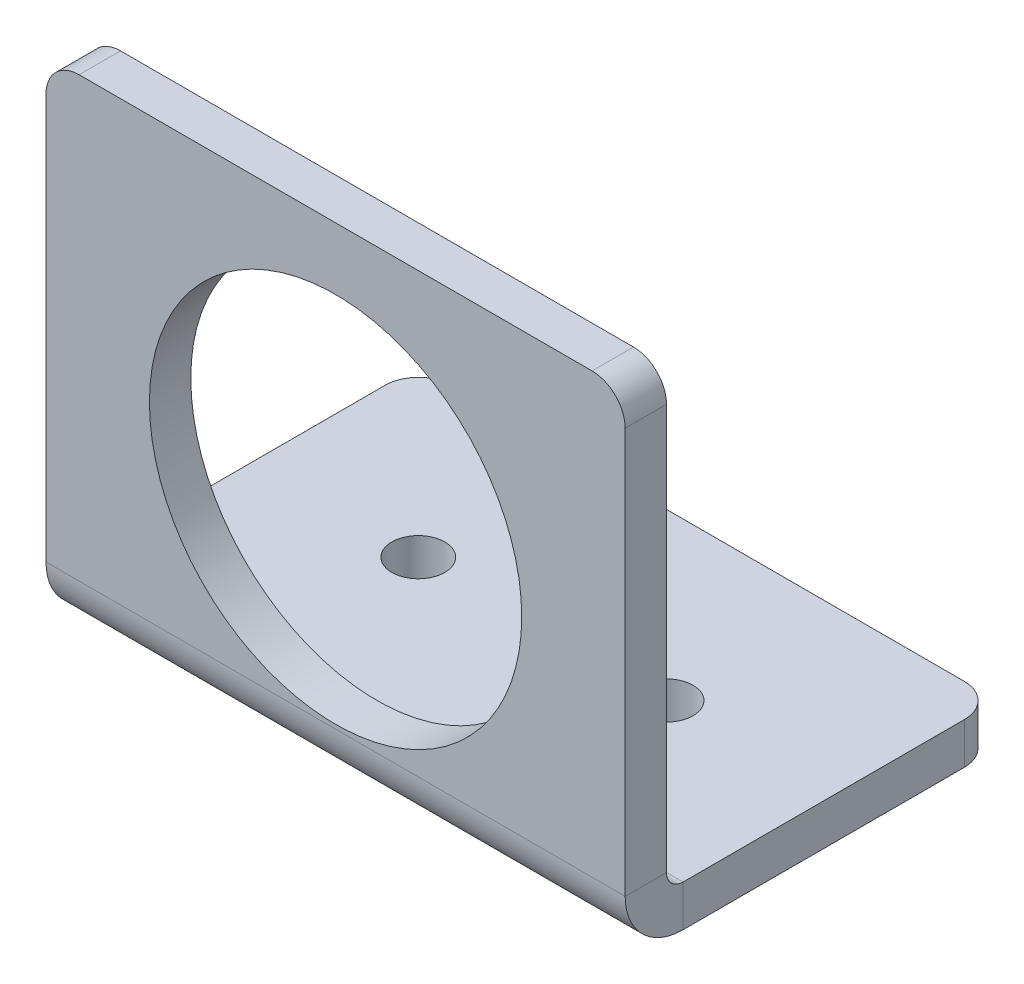
ISO-10303-21;
HEADER;
FILE_DESCRIPTION(('STEP AP214'),'2;1');
FILE_NAME('part.step','',(''),(''),'','','');
FILE_SCHEMA(('AUTOMOTIVE_DESIGN { 1 0 10303 214 1 1 1 1 }'));
ENDSEC;
DATA;
#1=APPLICATION_CONTEXT('core data for automotive mechanical design processes');
#2=APPLICATION_PROTOCOL_DEFINITION('international standard','automotive_design',2000,#1);
#3=PRODUCT_CONTEXT('',#1,'mechanical');
#4=PRODUCT('Part','Part','',(#3));
#5=PRODUCT_RELATED_PRODUCT_CATEGORY('part','',(#4));
#6=PRODUCT_DEFINITION_FORMATION('','',#4);
#7=PRODUCT_DEFINITION_CONTEXT('part definition',#1,'design');
#8=PRODUCT_DEFINITION('design','',#6,#7);
#9=PRODUCT_DEFINITION_SHAPE('','',#8);
#10=(LENGTH_UNIT() NAMED_UNIT(*) SI_UNIT(.MILLI.,.METRE.));
#11=(NAMED_UNIT(*) PLANE_ANGLE_UNIT() SI_UNIT($,.RADIAN.));
#12=(NAMED_UNIT(*) SI_UNIT($,.STERADIAN.) SOLID_ANGLE_UNIT());
#13=UNCERTAINTY_MEASURE_WITH_UNIT(LENGTH_MEASURE(1.E-05),#10,'distance_accuracy_value','');
#14=(GEOMETRIC_REPRESENTATION_CONTEXT(3) GLOBAL_UNCERTAINTY_ASSIGNED_CONTEXT((#13)) GLOBAL_UNIT_ASSIGNED_CONTEXT((#10,
#11,#12)) REPRESENTATION_CONTEXT('',''));
#15=CARTESIAN_POINT('',(0.,0.,0.));
#16=DIRECTION('',(0.,0.,1.));
#17=DIRECTION('',(1.,0.,0.));
#18=AXIS2_PLACEMENT_3D('',#15,#16,#17);
#19=CARTESIAN_POINT('',(22.225,-15.875,-25.4));
#20=DIRECTION('',(1.,0.,0.));
#21=DIRECTION('',(0.,0.,1.));
#22=AXIS2_PLACEMENT_3D('',#19,#20,#21);
#23=PLANE('',#22);
#24=DIRECTION('',(0.,1.,0.));
#25=VECTOR('',#24,1.);
#26=CARTESIAN_POINT('',(22.225,-15.875,-1.27));
#27=LINE('',#26,#25);
#28=CARTESIAN_POINT('',(22.225,-19.05,-1.27));
#29=VERTEX_POINT('',#28);
#30=CARTESIAN_POINT('',(22.225,-15.875,-1.27));
#31=VERTEX_POINT('',#30);
#32=EDGE_CURVE('E11',#29,#31,#27,.T.);
#33=ORIENTED_EDGE('',*,*,#32,.F.);
#34=DIRECTION('',(0.,0.,-1.));
#35=VECTOR('',#34,1.);
#36=CARTESIAN_POINT('',(22.225,-19.05,-25.4));
#37=LINE('',#36,#35);
#38=CARTESIAN_POINT('',(22.225,-19.05,-22.86));
#39=VERTEX_POINT('',#38);
#40=EDGE_CURVE('E99',#39,#29,#37,.F.);
#41=ORIENTED_EDGE('',*,*,#40,.F.);
#42=DIRECTION('',(0.,1.,0.));
#43=VECTOR('',#42,1.);
#44=CARTESIAN_POINT('',(22.225,-15.875,-22.86));
#45=LINE('',#44,#43);
#46=CARTESIAN_POINT('',(22.225,-15.875,-22.86));
#47=VERTEX_POINT('',#46);
#48=EDGE_CURVE('E48',#39,#47,#45,.T.);
#49=ORIENTED_EDGE('',*,*,#48,.T.);
#50=DIRECTION('',(0.,0.,1.));
#51=VECTOR('',#50,1.);
#52=CARTESIAN_POINT('',(22.225,-15.875,-25.4));
#53=LINE('',#52,#51);
#54=EDGE_CURVE('E102',#47,#31,#53,.T.);
#55=ORIENTED_EDGE('',*,*,#54,.T.);
#56=EDGE_LOOP('',(#33,#41,#49,#55));
#57=FACE_BOUND('',#56,.T.);
#58=ADVANCED_FACE('F38',(#57),#23,.T.);
#59=CARTESIAN_POINT('',(19.685,-15.875,-22.86));
#60=DIRECTION('',(0.,-1.,0.));
#61=DIRECTION('',(0.,0.,-1.));
#62=AXIS2_PLACEMENT_3D('',#59,#60,#61);
#63=CYLINDRICAL_SURFACE('',#62,2.54);
#64=ORIENTED_EDGE('',*,*,#48,.F.);
#65=CARTESIAN_POINT('',(19.685,-19.05,-22.86));
#66=DIRECTION('',(0.,-1.,0.));
#67=DIRECTION('',(0.,0.,-1.));
#68=AXIS2_PLACEMENT_3D('',#65,#66,#67);
#69=CIRCLE('',#68,2.54);
#70=CARTESIAN_POINT('',(19.685,-19.05,-25.4));
#71=VERTEX_POINT('',#70);
#72=EDGE_CURVE('E127',#39,#71,#69,.F.);
#73=ORIENTED_EDGE('',*,*,#72,.T.);
#74=DIRECTION('',(0.,1.,0.));
#75=VECTOR('',#74,1.);
#76=CARTESIAN_POINT('',(19.685,-15.875,-25.4));
#77=LINE('',#76,#75);
#78=CARTESIAN_POINT('',(19.685,-15.875,-25.4));
#79=VERTEX_POINT('',#78);
#80=EDGE_CURVE('E167',#71,#79,#77,.T.);
#81=ORIENTED_EDGE('',*,*,#80,.T.);
#82=CARTESIAN_POINT('',(19.685,-15.875,-22.86));
#83=DIRECTION('',(0.,-1.,0.));
#84=DIRECTION('',(0.,0.,-1.));
#85=AXIS2_PLACEMENT_3D('',#82,#83,#84);
#86=CIRCLE('',#85,2.54);
#87=EDGE_CURVE('E180',#47,#79,#86,.F.);
#88=ORIENTED_EDGE('',*,*,#87,.F.);
#89=EDGE_LOOP('',(#64,#73,#81,#88));
#90=FACE_BOUND('',#89,.T.);
#91=ADVANCED_FACE('F186',(#90),#63,.T.);
#92=CARTESIAN_POINT('',(22.225,-15.875,-25.4));
#93=DIRECTION('',(0.,0.,-1.));
#94=DIRECTION('',(1.,0.,0.));
#95=AXIS2_PLACEMENT_3D('',#92,#93,#94);
#96=PLANE('',#95);
#97=ORIENTED_EDGE('',*,*,#80,.F.);
#98=DIRECTION('',(1.,0.,0.));
#99=VECTOR('',#98,1.);
#100=CARTESIAN_POINT('',(22.225,-19.05,-25.4));
#101=LINE('',#100,#99);
#102=CARTESIAN_POINT('',(-19.685,-19.05,-25.4));
#103=VERTEX_POINT('',#102);
#104=EDGE_CURVE('E244',#103,#71,#101,.T.);
#105=ORIENTED_EDGE('',*,*,#104,.F.);
#106=DIRECTION('',(0.,1.,0.));
#107=VECTOR('',#106,1.);
#108=CARTESIAN_POINT('',(-19.685,-15.875,-25.4));
#109=LINE('',#108,#107);
#110=CARTESIAN_POINT('',(-19.685,-15.875,-25.4));
#111=VERTEX_POINT('',#110);
#112=EDGE_CURVE('E164',#103,#111,#109,.T.);
#113=ORIENTED_EDGE('',*,*,#112,.T.);
#114=DIRECTION('',(1.,0.,0.));
#115=VECTOR('',#114,1.);
#116=CARTESIAN_POINT('',(22.225,-15.875,-25.4));
#117=LINE('',#116,#115);
#118=EDGE_CURVE('E187',#111,#79,#117,.T.);
#119=ORIENTED_EDGE('',*,*,#118,.T.);
#120=EDGE_LOOP('',(#97,#105,#113,#119));
#121=FACE_BOUND('',#120,.T.);
#122=ADVANCED_FACE('F248',(#121),#96,.T.);
#123=CARTESIAN_POINT('',(-19.685,-15.875,-22.86));
#124=DIRECTION('',(0.,-1.,0.));
#125=DIRECTION('',(0.,0.,-1.));
#126=AXIS2_PLACEMENT_3D('',#123,#124,#125);
#127=CYLINDRICAL_SURFACE('',#126,2.54);
#128=ORIENTED_EDGE('',*,*,#112,.F.);
#129=CARTESIAN_POINT('',(-19.685,-19.05,-22.86));
#130=DIRECTION('',(0.,-1.,0.));
#131=DIRECTION('',(0.,0.,-1.));
#132=AXIS2_PLACEMENT_3D('',#129,#130,#131);
#133=CIRCLE('',#132,2.54);
#134=CARTESIAN_POINT('',(-22.225,-19.05,-22.86));
#135=VERTEX_POINT('',#134);
#136=EDGE_CURVE('E241',#103,#135,#133,.F.);
#137=ORIENTED_EDGE('',*,*,#136,.T.);
#138=DIRECTION('',(0.,1.,0.));
#139=VECTOR('',#138,1.);
#140=CARTESIAN_POINT('',(-22.225,-15.875,-22.86));
#141=LINE('',#140,#139);
#142=CARTESIAN_POINT('',(-22.225,-15.875,-22.86));
#143=VERTEX_POINT('',#142);
#144=EDGE_CURVE('E161',#135,#143,#141,.T.);
#145=ORIENTED_EDGE('',*,*,#144,.T.);
#146=CARTESIAN_POINT('',(-19.685,-15.875,-22.86));
#147=DIRECTION('',(0.,-1.,0.));
#148=DIRECTION('',(0.,0.,-1.));
#149=AXIS2_PLACEMENT_3D('',#146,#147,#148);
#150=CIRCLE('',#149,2.54);
#151=EDGE_CURVE('E189',#111,#143,#150,.F.);
#152=ORIENTED_EDGE('',*,*,#151,.F.);
#153=EDGE_LOOP('',(#128,#137,#145,#152));
#154=FACE_BOUND('',#153,.T.);
#155=ADVANCED_FACE('F256',(#154),#127,.T.);
#156=CARTESIAN_POINT('',(-22.225,-15.875,-25.4));
#157=DIRECTION('',(1.,0.,0.));
#158=DIRECTION('',(0.,0.,1.));
#159=AXIS2_PLACEMENT_3D('',#156,#157,#158);
#160=PLANE('',#159);
#161=ORIENTED_EDGE('',*,*,#144,.F.);
#162=DIRECTION('',(0.,0.,-1.));
#163=VECTOR('',#162,1.);
#164=CARTESIAN_POINT('',(-22.225,-19.05,-25.4));
#165=LINE('',#164,#163);
#166=CARTESIAN_POINT('',(-22.225,-19.05,-1.27));
#167=VERTEX_POINT('',#166);
#168=EDGE_CURVE('E238',#135,#167,#165,.F.);
#169=ORIENTED_EDGE('',*,*,#168,.T.);
#170=DIRECTION('',(0.,1.,0.));
#171=VECTOR('',#170,1.);
#172=CARTESIAN_POINT('',(-22.225,-15.875,-1.27));
#173=LINE('',#172,#171);
#174=CARTESIAN_POINT('',(-22.225,-15.875,-1.27));
#175=VERTEX_POINT('',#174);
#176=EDGE_CURVE('E158',#167,#175,#173,.T.);
#177=ORIENTED_EDGE('',*,*,#176,.T.);
#178=DIRECTION('',(0.,0.,1.));
#179=VECTOR('',#178,1.);
#180=CARTESIAN_POINT('',(-22.225,-15.875,-25.4));
#181=LINE('',#180,#179);
#182=EDGE_CURVE('E195',#143,#175,#181,.T.);
#183=ORIENTED_EDGE('',*,*,#182,.F.);
#184=EDGE_LOOP('',(#161,#169,#177,#183));
#185=FACE_BOUND('',#184,.T.);
#186=ADVANCED_FACE('F260',(#185),#160,.F.);
#187=CARTESIAN_POINT('',(-22.225,-14.605,-1.27));
#188=DIRECTION('',(1.,0.,0.));
#189=DIRECTION('',(0.,0.,-1.));
#190=AXIS2_PLACEMENT_3D('',#187,#188,#189);
#191=PLANE('',#190);
#192=ORIENTED_EDGE('',*,*,#176,.F.);
#193=CARTESIAN_POINT('',(-22.225,-14.605,-1.27));
#194=DIRECTION('',(1.,0.,0.));
#195=DIRECTION('',(0.,0.,-1.));
#196=AXIS2_PLACEMENT_3D('',#193,#194,#195);
#197=CIRCLE('',#196,4.445);
#198=CARTESIAN_POINT('',(-22.225,-14.605,3.175));
#199=VERTEX_POINT('',#198);
#200=EDGE_CURVE('E116',#167,#199,#197,.F.);
#201=ORIENTED_EDGE('',*,*,#200,.T.);
#202=DIRECTION('',(0.,0.,-1.));
#203=VECTOR('',#202,1.);
#204=CARTESIAN_POINT('',(-22.225,-14.605,0.));
#205=LINE('',#204,#203);
#206=CARTESIAN_POINT('',(-22.225,-14.605,0.));
#207=VERTEX_POINT('',#206);
#208=EDGE_CURVE('E156',#199,#207,#205,.T.);
#209=ORIENTED_EDGE('',*,*,#208,.T.);
#210=CARTESIAN_POINT('',(-22.225,-14.605,-1.27));
#211=DIRECTION('',(-1.,0.,0.));
#212=DIRECTION('',(0.,0.,1.));
#213=AXIS2_PLACEMENT_3D('',#210,#211,#212);
#214=CIRCLE('',#213,1.27);
#215=EDGE_CURVE('E220',#175,#207,#214,.T.);
#216=ORIENTED_EDGE('',*,*,#215,.F.);
#217=EDGE_LOOP('',(#192,#201,#209,#216));
#218=FACE_BOUND('',#217,.T.);
#219=ADVANCED_FACE('F263',(#218),#191,.F.);
#220=CARTESIAN_POINT('',(-22.225,-19.05,0.));
#221=DIRECTION('',(1.,0.,0.));
#222=DIRECTION('',(0.,-1.,0.));
#223=AXIS2_PLACEMENT_3D('',#220,#221,#222);
#224=PLANE('',#223);
#225=ORIENTED_EDGE('',*,*,#208,.F.);
#226=DIRECTION('',(0.,1.,0.));
#227=VECTOR('',#226,1.);
#228=CARTESIAN_POINT('',(-22.225,16.51,3.175));
#229=LINE('',#228,#227);
#230=CARTESIAN_POINT('',(-22.225,16.51,3.175));
#231=VERTEX_POINT('',#230);
#232=EDGE_CURVE('E236',#231,#199,#229,.F.);
#233=ORIENTED_EDGE('',*,*,#232,.F.);
#234=DIRECTION('',(0.,0.,-1.));
#235=VECTOR('',#234,1.);
#236=CARTESIAN_POINT('',(-22.225,16.51,0.));
#237=LINE('',#236,#235);
#238=CARTESIAN_POINT('',(-22.225,16.51,0.));
#239=VERTEX_POINT('',#238);
#240=EDGE_CURVE('E153',#231,#239,#237,.T.);
#241=ORIENTED_EDGE('',*,*,#240,.T.);
#242=DIRECTION('',(0.,-1.,0.));
#243=VECTOR('',#242,1.);
#244=CARTESIAN_POINT('',(-22.225,-19.05,0.));
#245=LINE('',#244,#243);
#246=EDGE_CURVE('E197',#239,#207,#245,.T.);
#247=ORIENTED_EDGE('',*,*,#246,.T.);
#248=EDGE_LOOP('',(#225,#233,#241,#247));
#249=FACE_BOUND('',#248,.T.);
#250=ADVANCED_FACE('F287',(#249),#224,.F.);
#251=CARTESIAN_POINT('',(-19.685,16.51,0.));
#252=DIRECTION('',(0.,0.,-1.));
#253=DIRECTION('',(-1.,0.,0.));
#254=AXIS2_PLACEMENT_3D('',#251,#252,#253);
#255=CYLINDRICAL_SURFACE('',#254,2.54);
#256=ORIENTED_EDGE('',*,*,#240,.F.);
#257=CARTESIAN_POINT('',(-19.685,16.51,3.175));
#258=DIRECTION('',(0.,0.,1.));
#259=DIRECTION('',(1.,0.,0.));
#260=AXIS2_PLACEMENT_3D('',#257,#258,#259);
#261=CIRCLE('',#260,2.54);
#262=CARTESIAN_POINT('',(-19.685,19.05,3.175));
#263=VERTEX_POINT('',#262);
#264=EDGE_CURVE('E233',#263,#231,#261,.T.);
#265=ORIENTED_EDGE('',*,*,#264,.F.);
#266=DIRECTION('',(0.,0.,-1.));
#267=VECTOR('',#266,1.);
#268=CARTESIAN_POINT('',(-19.685,19.05,0.));
#269=LINE('',#268,#267);
#270=CARTESIAN_POINT('',(-19.685,19.05,0.));
#271=VERTEX_POINT('',#270);
#272=EDGE_CURVE('E150',#263,#271,#269,.T.);
#273=ORIENTED_EDGE('',*,*,#272,.T.);
#274=CARTESIAN_POINT('',(-19.685,16.51,0.));
#275=DIRECTION('',(0.,0.,1.));
#276=DIRECTION('',(-1.,0.,0.));
#277=AXIS2_PLACEMENT_3D('',#274,#275,#276);
#278=CIRCLE('',#277,2.54);
#279=EDGE_CURVE('E200',#271,#239,#278,.T.);
#280=ORIENTED_EDGE('',*,*,#279,.T.);
#281=EDGE_LOOP('',(#256,#265,#273,#280));
#282=FACE_BOUND('',#281,.T.);
#283=ADVANCED_FACE('F291',(#282),#255,.T.);
#284=CARTESIAN_POINT('',(-19.685,19.05,0.));
#285=DIRECTION('',(0.,-1.,0.));
#286=DIRECTION('',(-1.,0.,0.));
#287=AXIS2_PLACEMENT_3D('',#284,#285,#286);
#288=PLANE('',#287);
#289=ORIENTED_EDGE('',*,*,#272,.F.);
#290=DIRECTION('',(-1.,0.,0.));
#291=VECTOR('',#290,1.);
#292=CARTESIAN_POINT('',(-19.685,19.05,3.175));
#293=LINE('',#292,#291);
#294=CARTESIAN_POINT('',(19.685,19.05,3.175));
#295=VERTEX_POINT('',#294);
#296=EDGE_CURVE('E230',#295,#263,#293,.T.);
#297=ORIENTED_EDGE('',*,*,#296,.F.);
#298=DIRECTION('',(0.,0.,-1.));
#299=VECTOR('',#298,1.);
#300=CARTESIAN_POINT('',(19.685,19.05,0.));
#301=LINE('',#300,#299);
#302=CARTESIAN_POINT('',(19.685,19.05,0.));
#303=VERTEX_POINT('',#302);
#304=EDGE_CURVE('E147',#295,#303,#301,.T.);
#305=ORIENTED_EDGE('',*,*,#304,.T.);
#306=DIRECTION('',(-1.,0.,0.));
#307=VECTOR('',#306,1.);
#308=CARTESIAN_POINT('',(-19.685,19.05,0.));
#309=LINE('',#308,#307);
#310=EDGE_CURVE('E203',#303,#271,#309,.T.);
#311=ORIENTED_EDGE('',*,*,#310,.T.);
#312=EDGE_LOOP('',(#289,#297,#305,#311));
#313=FACE_BOUND('',#312,.T.);
#314=ADVANCED_FACE('F294',(#313),#288,.F.);
#315=CARTESIAN_POINT('',(19.685,16.51,0.));
#316=DIRECTION('',(0.,0.,-1.));
#317=DIRECTION('',(-1.,0.,0.));
#318=AXIS2_PLACEMENT_3D('',#315,#316,#317);
#319=CYLINDRICAL_SURFACE('',#318,2.54);
#320=ORIENTED_EDGE('',*,*,#304,.F.);
#321=CARTESIAN_POINT('',(19.685,16.51,3.175));
#322=DIRECTION('',(0.,0.,1.));
#323=DIRECTION('',(1.,0.,0.));
#324=AXIS2_PLACEMENT_3D('',#321,#322,#323);
#325=CIRCLE('',#324,2.54);
#326=CARTESIAN_POINT('',(22.225,16.51,3.175));
#327=VERTEX_POINT('',#326);
#328=EDGE_CURVE('E227',#327,#295,#325,.T.);
#329=ORIENTED_EDGE('',*,*,#328,.F.);
#330=DIRECTION('',(0.,0.,-1.));
#331=VECTOR('',#330,1.);
#332=CARTESIAN_POINT('',(22.225,16.51,0.));
#333=LINE('',#332,#331);
#334=CARTESIAN_POINT('',(22.225,16.51,0.));
#335=VERTEX_POINT('',#334);
#336=EDGE_CURVE('E144',#327,#335,#333,.T.);
#337=ORIENTED_EDGE('',*,*,#336,.T.);
#338=CARTESIAN_POINT('',(19.685,16.51,0.));
#339=DIRECTION('',(0.,0.,1.));
#340=DIRECTION('',(1.,0.,0.));
#341=AXIS2_PLACEMENT_3D('',#338,#339,#340);
#342=CIRCLE('',#341,2.54);
#343=EDGE_CURVE('E206',#335,#303,#342,.T.);
#344=ORIENTED_EDGE('',*,*,#343,.T.);
#345=EDGE_LOOP('',(#320,#329,#337,#344));
#346=FACE_BOUND('',#345,.T.);
#347=ADVANCED_FACE('F298',(#346),#319,.T.);
#348=CARTESIAN_POINT('',(22.225,-19.05,0.));
#349=DIRECTION('',(-1.,0.,0.));
#350=DIRECTION('',(0.,1.,0.));
#351=AXIS2_PLACEMENT_3D('',#348,#349,#350);
#352=PLANE('',#351);
#353=ORIENTED_EDGE('',*,*,#336,.F.);
#354=DIRECTION('',(0.,1.,0.));
#355=VECTOR('',#354,1.);
#356=CARTESIAN_POINT('',(22.225,16.51,3.175));
#357=LINE('',#356,#355);
#358=CARTESIAN_POINT('',(22.225,-14.605,3.175));
#359=VERTEX_POINT('',#358);
#360=EDGE_CURVE('E139',#359,#327,#357,.T.);
#361=ORIENTED_EDGE('',*,*,#360,.F.);
#362=DIRECTION('',(0.,0.,-1.));
#363=VECTOR('',#362,1.);
#364=CARTESIAN_POINT('',(22.225,-14.605,0.));
#365=LINE('',#364,#363);
#366=CARTESIAN_POINT('',(22.225,-14.605,0.));
#367=VERTEX_POINT('',#366);
#368=EDGE_CURVE('E42',#359,#367,#365,.T.);
#369=ORIENTED_EDGE('',*,*,#368,.T.);
#370=DIRECTION('',(0.,1.,0.));
#371=VECTOR('',#370,1.);
#372=CARTESIAN_POINT('',(22.225,-19.05,0.));
#373=LINE('',#372,#371);
#374=EDGE_CURVE('E209',#367,#335,#373,.T.);
#375=ORIENTED_EDGE('',*,*,#374,.T.);
#376=EDGE_LOOP('',(#353,#361,#369,#375));
#377=FACE_BOUND('',#376,.T.);
#378=ADVANCED_FACE('F276',(#377),#352,.F.);
#379=CARTESIAN_POINT('',(-9.525,-15.875,-12.7));
#380=DIRECTION('',(0.,-1.,0.));
#381=DIRECTION('',(0.,0.,-1.));
#382=AXIS2_PLACEMENT_3D('',#379,#380,#381);
#383=CYLINDRICAL_SURFACE('',#382,2.032);
#384=CARTESIAN_POINT('',(-9.525,-15.875,-12.7));
#385=DIRECTION('',(0.,1.,0.));
#386=DIRECTION('',(0.,0.,1.));
#387=AXIS2_PLACEMENT_3D('',#384,#385,#386);
#388=CIRCLE('',#387,2.032);
#389=CARTESIAN_POINT('',(-9.525,-15.875,-10.668));
#390=VERTEX_POINT('',#389);
#391=EDGE_CURVE('E223',#390,#390,#388,.T.);
#392=ORIENTED_EDGE('',*,*,#391,.T.);
#393=EDGE_LOOP('',(#392));
#394=FACE_BOUND('',#393,.T.);
#395=CARTESIAN_POINT('',(-9.525,-19.05,-12.7));
#396=DIRECTION('',(0.,1.,0.));
#397=DIRECTION('',(0.,0.,1.));
#398=AXIS2_PLACEMENT_3D('',#395,#396,#397);
#399=CIRCLE('',#398,2.032);
#400=CARTESIAN_POINT('',(-9.525,-19.05,-10.668));
#401=VERTEX_POINT('',#400);
#402=EDGE_CURVE('E133',#401,#401,#399,.T.);
#403=ORIENTED_EDGE('',*,*,#402,.F.);
#404=EDGE_LOOP('',(#403));
#405=FACE_BOUND('',#404,.T.);
#406=ADVANCED_FACE('F305',(#394,#405),#383,.F.);
#407=CARTESIAN_POINT('',(9.525,-15.875,-12.7));
#408=DIRECTION('',(0.,-1.,0.));
#409=DIRECTION('',(0.,0.,-1.));
#410=AXIS2_PLACEMENT_3D('',#407,#408,#409);
#411=CYLINDRICAL_SURFACE('',#410,2.032);
#412=CARTESIAN_POINT('',(9.525,-15.875,-12.7));
#413=DIRECTION('',(0.,1.,0.));
#414=DIRECTION('',(0.,0.,1.));
#415=AXIS2_PLACEMENT_3D('',#412,#413,#414);
#416=CIRCLE('',#415,2.032);
#417=CARTESIAN_POINT('',(9.525,-15.875,-10.668));
#418=VERTEX_POINT('',#417);
#419=EDGE_CURVE('E184',#418,#418,#416,.T.);
#420=ORIENTED_EDGE('',*,*,#419,.T.);
#421=EDGE_LOOP('',(#420));
#422=FACE_BOUND('',#421,.T.);
#423=CARTESIAN_POINT('',(9.525,-19.05,-12.7));
#424=DIRECTION('',(0.,1.,0.));
#425=DIRECTION('',(0.,0.,1.));
#426=AXIS2_PLACEMENT_3D('',#423,#424,#425);
#427=CIRCLE('',#426,2.032);
#428=CARTESIAN_POINT('',(9.525,-19.05,-10.668));
#429=VERTEX_POINT('',#428);
#430=EDGE_CURVE('E128',#429,#429,#427,.T.);
#431=ORIENTED_EDGE('',*,*,#430,.F.);
#432=EDGE_LOOP('',(#431));
#433=FACE_BOUND('',#432,.T.);
#434=ADVANCED_FACE('F40',(#422,#433),#411,.F.);
#435=CARTESIAN_POINT('',(22.225,-14.605,-1.27));
#436=DIRECTION('',(1.,0.,0.));
#437=DIRECTION('',(0.,0.,-1.));
#438=AXIS2_PLACEMENT_3D('',#435,#436,#437);
#439=PLANE('',#438);
#440=CARTESIAN_POINT('',(22.225,-14.605,-1.27));
#441=DIRECTION('',(1.,0.,0.));
#442=DIRECTION('',(0.,0.,-1.));
#443=AXIS2_PLACEMENT_3D('',#440,#441,#442);
#444=CIRCLE('',#443,4.445);
#445=EDGE_CURVE('E114',#359,#29,#444,.T.);
#446=ORIENTED_EDGE('',*,*,#445,.T.);
#447=ORIENTED_EDGE('',*,*,#32,.T.);
#448=CARTESIAN_POINT('',(22.225,-14.605,-1.27));
#449=DIRECTION('',(-1.,0.,0.));
#450=DIRECTION('',(0.,0.,1.));
#451=AXIS2_PLACEMENT_3D('',#448,#449,#450);
#452=CIRCLE('',#451,1.27);
#453=EDGE_CURVE('E218',#367,#31,#452,.F.);
#454=ORIENTED_EDGE('',*,*,#453,.F.);
#455=ORIENTED_EDGE('',*,*,#368,.F.);
#456=EDGE_LOOP('',(#446,#447,#454,#455));
#457=FACE_BOUND('',#456,.T.);
#458=ADVANCED_FACE('F130',(#457),#439,.T.);
#459=CARTESIAN_POINT('',(0.,0.,0.));
#460=DIRECTION('',(0.,0.,-1.));
#461=DIRECTION('',(-1.,0.,0.));
#462=AXIS2_PLACEMENT_3D('',#459,#460,#461);
#463=CYLINDRICAL_SURFACE('',#462,14.2875);
#464=CARTESIAN_POINT('',(0.,0.,0.));
#465=DIRECTION('',(0.,0.,1.));
#466=DIRECTION('',(1.,0.,0.));
#467=AXIS2_PLACEMENT_3D('',#464,#465,#466);
#468=CIRCLE('',#467,14.2875);
#469=CARTESIAN_POINT('',(14.2875,0.,0.));
#470=VERTEX_POINT('',#469);
#471=EDGE_CURVE('E211',#470,#470,#468,.T.);
#472=ORIENTED_EDGE('',*,*,#471,.F.);
#473=EDGE_LOOP('',(#472));
#474=FACE_BOUND('',#473,.T.);
#475=CARTESIAN_POINT('',(0.,0.,3.175));
#476=DIRECTION('',(0.,0.,1.));
#477=DIRECTION('',(1.,0.,0.));
#478=AXIS2_PLACEMENT_3D('',#475,#476,#477);
#479=CIRCLE('',#478,14.2875);
#480=CARTESIAN_POINT('',(14.2875,0.,3.175));
#481=VERTEX_POINT('',#480);
#482=EDGE_CURVE('E121',#481,#481,#479,.T.);
#483=ORIENTED_EDGE('',*,*,#482,.T.);
#484=EDGE_LOOP('',(#483));
#485=FACE_BOUND('',#484,.T.);
#486=ADVANCED_FACE('F318',(#474,#485),#463,.F.);
#487=CARTESIAN_POINT('',(-19.685,16.51,0.));
#488=DIRECTION('',(0.,0.,-1.));
#489=DIRECTION('',(-1.,0.,0.));
#490=AXIS2_PLACEMENT_3D('',#487,#488,#489);
#491=PLANE('',#490);
#492=ORIENTED_EDGE('',*,*,#374,.F.);
#493=DIRECTION('',(1.,0.,0.));
#494=VECTOR('',#493,1.);
#495=CARTESIAN_POINT('',(-19.685,-14.605,0.));
#496=LINE('',#495,#494);
#497=EDGE_CURVE('E215',#367,#207,#496,.F.);
#498=ORIENTED_EDGE('',*,*,#497,.T.);
#499=ORIENTED_EDGE('',*,*,#246,.F.);
#500=ORIENTED_EDGE('',*,*,#279,.F.);
#501=ORIENTED_EDGE('',*,*,#310,.F.);
#502=ORIENTED_EDGE('',*,*,#343,.F.);
#503=EDGE_LOOP('',(#492,#498,#499,#500,#501,#502));
#504=FACE_BOUND('',#503,.T.);
#505=ORIENTED_EDGE('',*,*,#471,.T.);
#506=EDGE_LOOP('',(#505));
#507=FACE_BOUND('',#506,.T.);
#508=ADVANCED_FACE('F272',(#504,#507),#491,.T.);
#509=CARTESIAN_POINT('',(22.225,-15.875,-25.4));
#510=DIRECTION('',(0.,-1.,0.));
#511=DIRECTION('',(0.,0.,-1.));
#512=AXIS2_PLACEMENT_3D('',#509,#510,#511);
#513=PLANE('',#512);
#514=ORIENTED_EDGE('',*,*,#391,.F.);
#515=EDGE_LOOP('',(#514));
#516=FACE_BOUND('',#515,.T.);
#517=ORIENTED_EDGE('',*,*,#419,.F.);
#518=EDGE_LOOP('',(#517));
#519=FACE_BOUND('',#518,.T.);
#520=ORIENTED_EDGE('',*,*,#182,.T.);
#521=DIRECTION('',(1.,0.,0.));
#522=VECTOR('',#521,1.);
#523=CARTESIAN_POINT('',(22.225,-15.875,-1.27));
#524=LINE('',#523,#522);
#525=EDGE_CURVE('E183',#175,#31,#524,.T.);
#526=ORIENTED_EDGE('',*,*,#525,.T.);
#527=ORIENTED_EDGE('',*,*,#54,.F.);
#528=ORIENTED_EDGE('',*,*,#87,.T.);
#529=ORIENTED_EDGE('',*,*,#118,.F.);
#530=ORIENTED_EDGE('',*,*,#151,.T.);
#531=EDGE_LOOP('',(#520,#526,#527,#528,#529,#530));
#532=FACE_BOUND('',#531,.T.);
#533=ADVANCED_FACE('F178',(#516,#519,#532),#513,.F.);
#534=CARTESIAN_POINT('',(22.225,-14.605,-1.27));
#535=DIRECTION('',(1.,0.,0.));
#536=DIRECTION('',(0.,0.,-1.));
#537=AXIS2_PLACEMENT_3D('',#534,#535,#536);
#538=CYLINDRICAL_SURFACE('',#537,1.27);
#539=ORIENTED_EDGE('',*,*,#215,.T.);
#540=ORIENTED_EDGE('',*,*,#497,.F.);
#541=ORIENTED_EDGE('',*,*,#453,.T.);
#542=ORIENTED_EDGE('',*,*,#525,.F.);
#543=EDGE_LOOP('',(#539,#540,#541,#542));
#544=FACE_BOUND('',#543,.T.);
#545=ADVANCED_FACE('F266',(#544),#538,.F.);
#546=CARTESIAN_POINT('',(-19.685,16.51,3.175));
#547=DIRECTION('',(0.,0.,-1.));
#548=DIRECTION('',(-1.,0.,0.));
#549=AXIS2_PLACEMENT_3D('',#546,#547,#548);
#550=PLANE('',#549);
#551=ORIENTED_EDGE('',*,*,#360,.T.);
#552=ORIENTED_EDGE('',*,*,#328,.T.);
#553=ORIENTED_EDGE('',*,*,#296,.T.);
#554=ORIENTED_EDGE('',*,*,#264,.T.);
#555=ORIENTED_EDGE('',*,*,#232,.T.);
#556=DIRECTION('',(-1.,0.,0.));
#557=VECTOR('',#556,1.);
#558=CARTESIAN_POINT('',(-19.685,-14.605,3.175));
#559=LINE('',#558,#557);
#560=EDGE_CURVE('E120',#359,#199,#559,.T.);
#561=ORIENTED_EDGE('',*,*,#560,.F.);
#562=EDGE_LOOP('',(#551,#552,#553,#554,#555,#561));
#563=FACE_BOUND('',#562,.T.);
#564=ORIENTED_EDGE('',*,*,#482,.F.);
#565=EDGE_LOOP('',(#564));
#566=FACE_BOUND('',#565,.T.);
#567=ADVANCED_FACE('F296',(#563,#566),#550,.F.);
#568=CARTESIAN_POINT('',(22.225,-19.05,-25.4));
#569=DIRECTION('',(0.,-1.,0.));
#570=DIRECTION('',(0.,0.,-1.));
#571=AXIS2_PLACEMENT_3D('',#568,#569,#570);
#572=PLANE('',#571);
#573=ORIENTED_EDGE('',*,*,#402,.T.);
#574=EDGE_LOOP('',(#573));
#575=FACE_BOUND('',#574,.T.);
#576=ORIENTED_EDGE('',*,*,#430,.T.);
#577=EDGE_LOOP('',(#576));
#578=FACE_BOUND('',#577,.T.);
#579=ORIENTED_EDGE('',*,*,#168,.F.);
#580=ORIENTED_EDGE('',*,*,#136,.F.);
#581=ORIENTED_EDGE('',*,*,#104,.T.);
#582=ORIENTED_EDGE('',*,*,#72,.F.);
#583=ORIENTED_EDGE('',*,*,#40,.T.);
#584=DIRECTION('',(1.,0.,0.));
#585=VECTOR('',#584,1.);
#586=CARTESIAN_POINT('',(22.225,-19.05,-1.27));
#587=LINE('',#586,#585);
#588=EDGE_CURVE('E111',#167,#29,#587,.T.);
#589=ORIENTED_EDGE('',*,*,#588,.F.);
#590=EDGE_LOOP('',(#579,#580,#581,#582,#583,#589));
#591=FACE_BOUND('',#590,.T.);
#592=ADVANCED_FACE('F124',(#575,#578,#591),#572,.T.);
#593=CARTESIAN_POINT('',(22.225,-14.605,-1.27));
#594=DIRECTION('',(1.,0.,0.));
#595=DIRECTION('',(0.,0.,-1.));
#596=AXIS2_PLACEMENT_3D('',#593,#594,#595);
#597=CYLINDRICAL_SURFACE('',#596,4.445);
#598=ORIENTED_EDGE('',*,*,#200,.F.);
#599=ORIENTED_EDGE('',*,*,#588,.T.);
#600=ORIENTED_EDGE('',*,*,#445,.F.);
#601=ORIENTED_EDGE('',*,*,#560,.T.);
#602=EDGE_LOOP('',(#598,#599,#600,#601));
#603=FACE_BOUND('',#602,.T.);
#604=ADVANCED_FACE('F112',(#603),#597,.T.);
#605=CLOSED_SHELL('',(#58,#91,#122,#155,#186,#219,#250,#283,#314,#347,#378,#406,#434,#458,#486,
#508,#533,#545,#567,#592,#604));
#606=MANIFOLD_SOLID_BREP('B2',#605);
#607=ADVANCED_BREP_SHAPE_REPRESENTATION('',(#18,#606),#14);
#608=SHAPE_DEFINITION_REPRESENTATION(#9,#607);
ENDSEC;
END-ISO-10303-21;
